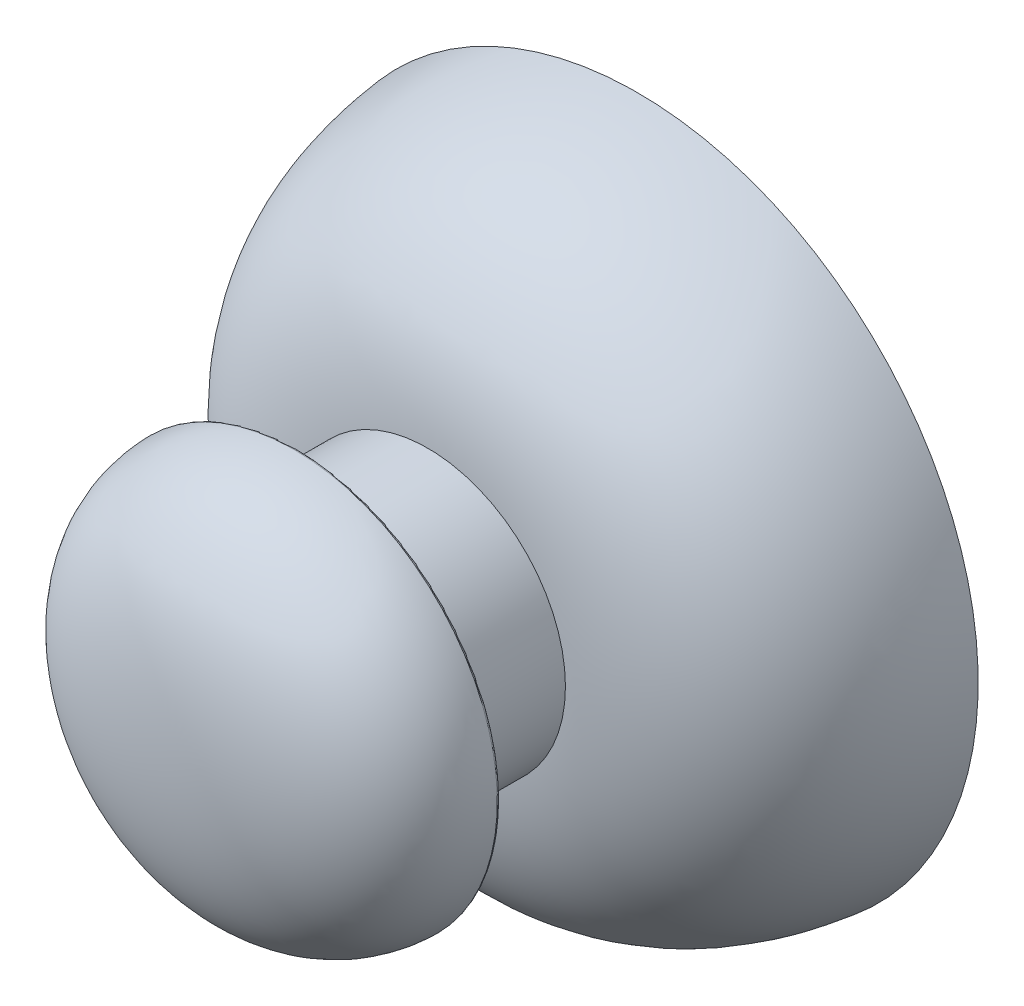
ISO-10303-21;
HEADER;
FILE_DESCRIPTION(('STEP AP214'),'2;1');
FILE_NAME('part.step','',(''),(''),'','','');
FILE_SCHEMA(('AUTOMOTIVE_DESIGN { 1 0 10303 214 1 1 1 1 }'));
ENDSEC;
DATA;
#1=APPLICATION_CONTEXT('core data for automotive mechanical design processes');
#2=APPLICATION_PROTOCOL_DEFINITION('international standard','automotive_design',2000,#1);
#3=PRODUCT_CONTEXT('',#1,'mechanical');
#4=PRODUCT('Part','Part','',(#3));
#5=PRODUCT_RELATED_PRODUCT_CATEGORY('part','',(#4));
#6=PRODUCT_DEFINITION_FORMATION('','',#4);
#7=PRODUCT_DEFINITION_CONTEXT('part definition',#1,'design');
#8=PRODUCT_DEFINITION('design','',#6,#7);
#9=PRODUCT_DEFINITION_SHAPE('','',#8);
#10=(LENGTH_UNIT() NAMED_UNIT(*) SI_UNIT(.MILLI.,.METRE.));
#11=(NAMED_UNIT(*) PLANE_ANGLE_UNIT() SI_UNIT($,.RADIAN.));
#12=(NAMED_UNIT(*) SI_UNIT($,.STERADIAN.) SOLID_ANGLE_UNIT());
#13=UNCERTAINTY_MEASURE_WITH_UNIT(LENGTH_MEASURE(1.E-05),#10,'distance_accuracy_value','');
#14=(GEOMETRIC_REPRESENTATION_CONTEXT(3) GLOBAL_UNCERTAINTY_ASSIGNED_CONTEXT((#13)) GLOBAL_UNIT_ASSIGNED_CONTEXT((#10,
#11,#12)) REPRESENTATION_CONTEXT('',''));
#15=CARTESIAN_POINT('',(0.,0.,0.));
#16=DIRECTION('',(0.,0.,1.));
#17=DIRECTION('',(1.,0.,0.));
#18=AXIS2_PLACEMENT_3D('',#15,#16,#17);
#19=CARTESIAN_POINT('',(0.,0.,0.));
#20=DIRECTION('',(0.,0.,1.));
#21=DIRECTION('',(1.,0.,0.));
#22=AXIS2_PLACEMENT_3D('',#19,#20,#21);
#23=PLANE('',#22);
#24=CARTESIAN_POINT('',(0.,0.,0.));
#25=DIRECTION('',(0.,0.,-1.));
#26=DIRECTION('',(-1.,0.,0.));
#27=AXIS2_PLACEMENT_3D('',#24,#25,#26);
#28=CIRCLE('',#27,13.);
#29=CARTESIAN_POINT('',(-13.,0.,0.));
#30=VERTEX_POINT('',#29);
#31=EDGE_CURVE('E82',#30,#30,#28,.T.);
#32=ORIENTED_EDGE('',*,*,#31,.T.);
#33=EDGE_LOOP('',(#32));
#34=FACE_BOUND('',#33,.T.);
#35=ADVANCED_FACE('F38',(#34),#23,.F.);
#36=CARTESIAN_POINT('',(0.,-5.24999999999999,8.));
#37=CARTESIAN_POINT('',(0.,-9.67903261933591,7.74672348654233));
#38=CARTESIAN_POINT('',(0.,-12.4568639272417,5.06893435293801));
#39=CARTESIAN_POINT('',(0.,-13.,0.));
#40=B_SPLINE_CURVE_WITH_KNOTS('',3,(#36,#37,#38,#39),.UNSPECIFIED.,.F.,.F.,(4,4),(0.,1.),.UNSPECIFIED.);
#41=CARTESIAN_POINT('',(0.,0.,0.));
#42=DIRECTION('',(0.,0.,-1.));
#43=AXIS1_PLACEMENT('',#41,#42);
#44=SURFACE_OF_REVOLUTION('',#40,#43);
#45=ORIENTED_EDGE('',*,*,#31,.F.);
#46=EDGE_LOOP('',(#45));
#47=FACE_BOUND('',#46,.T.);
#48=CARTESIAN_POINT('',(0.,0.,8.));
#49=DIRECTION('',(0.,0.,1.));
#50=DIRECTION('',(1.,0.,0.));
#51=AXIS2_PLACEMENT_3D('',#48,#49,#50);
#52=CIRCLE('',#51,5.25);
#53=CARTESIAN_POINT('',(5.25,0.,8.));
#54=VERTEX_POINT('',#53);
#55=EDGE_CURVE('E81',#54,#54,#52,.T.);
#56=ORIENTED_EDGE('',*,*,#55,.F.);
#57=EDGE_LOOP('',(#56));
#58=FACE_BOUND('',#57,.T.);
#59=ADVANCED_FACE('F65',(#47,#58),#44,.T.);
#60=CARTESIAN_POINT('',(0.,0.,13.));
#61=DIRECTION('',(0.,0.,-1.));
#62=DIRECTION('',(-1.,0.,0.));
#63=AXIS2_PLACEMENT_3D('',#60,#61,#62);
#64=CYLINDRICAL_SURFACE('',#63,5.25);
#65=CARTESIAN_POINT('',(0.,0.,12.9));
#66=DIRECTION('',(0.,0.,-1.));
#67=DIRECTION('',(-1.,0.,0.));
#68=AXIS2_PLACEMENT_3D('',#65,#66,#67);
#69=CIRCLE('',#68,5.25);
#70=CARTESIAN_POINT('',(-5.25,0.,12.9));
#71=VERTEX_POINT('',#70);
#72=EDGE_CURVE('E11',#71,#71,#69,.T.);
#73=ORIENTED_EDGE('',*,*,#72,.T.);
#74=EDGE_LOOP('',(#73));
#75=FACE_BOUND('',#74,.T.);
#76=ORIENTED_EDGE('',*,*,#55,.T.);
#77=EDGE_LOOP('',(#76));
#78=FACE_BOUND('',#77,.T.);
#79=ADVANCED_FACE('F59',(#75,#78),#64,.T.);
#80=CARTESIAN_POINT('',(0.,7.75465321046683,13.));
#81=DIRECTION('',(0.,0.,-1.));
#82=DIRECTION('',(-1.,0.,0.));
#83=AXIS2_PLACEMENT_3D('',#80,#81,#82);
#84=PLANE('',#83);
#85=CARTESIAN_POINT('',(0.,0.,13.));
#86=DIRECTION('',(0.,0.,-1.));
#87=DIRECTION('',(-1.,0.,0.));
#88=AXIS2_PLACEMENT_3D('',#85,#86,#87);
#89=CIRCLE('',#88,7.65380865377125);
#90=CARTESIAN_POINT('',(-7.65380865377125,0.,13.));
#91=VERTEX_POINT('',#90);
#92=EDGE_CURVE('E90',#91,#91,#89,.T.);
#93=ORIENTED_EDGE('',*,*,#92,.T.);
#94=EDGE_LOOP('',(#93));
#95=FACE_BOUND('',#94,.T.);
#96=CARTESIAN_POINT('',(0.,0.,13.));
#97=DIRECTION('',(0.,0.,-1.));
#98=DIRECTION('',(-1.,0.,0.));
#99=AXIS2_PLACEMENT_3D('',#96,#97,#98);
#100=CIRCLE('',#99,5.35);
#101=CARTESIAN_POINT('',(-5.35,0.,13.));
#102=VERTEX_POINT('',#101);
#103=EDGE_CURVE('E87',#102,#102,#100,.F.);
#104=ORIENTED_EDGE('',*,*,#103,.T.);
#105=EDGE_LOOP('',(#104));
#106=FACE_BOUND('',#105,.T.);
#107=ADVANCED_FACE('F51',(#95,#106),#84,.T.);
#108=CARTESIAN_POINT('',(0.,7.75465321046683,13.));
#109=CARTESIAN_POINT('',(0.,7.75465321046684,13.9392610767587));
#110=CARTESIAN_POINT('',(0.,7.56404747964996,18.));
#111=CARTESIAN_POINT('',(0.,0.,18.));
#112=B_SPLINE_CURVE_WITH_KNOTS('',3,(#108,#109,#110,#111),.UNSPECIFIED.,.F.,.F.,(4,4),(0.,1.),.UNSPECIFIED.);
#113=CARTESIAN_POINT('',(0.,0.,13.));
#114=DIRECTION('',(0.,0.,-1.));
#115=AXIS1_PLACEMENT('',#113,#114);
#116=SURFACE_OF_REVOLUTION('',#112,#115);
#117=CARTESIAN_POINT('',(0.,0.,13.1017710128545));
#118=DIRECTION('',(0.,0.,-1.));
#119=DIRECTION('',(-1.,0.,0.));
#120=AXIS2_PLACEMENT_3D('',#117,#118,#119);
#121=CIRCLE('',#120,7.75379297010871);
#122=CARTESIAN_POINT('',(-7.75379297010871,0.,13.1017710128545));
#123=VERTEX_POINT('',#122);
#124=EDGE_CURVE('E45',#123,#123,#121,.F.);
#125=ORIENTED_EDGE('',*,*,#124,.T.);
#126=EDGE_LOOP('',(#125));
#127=FACE_BOUND('',#126,.T.);
#128=CARTESIAN_POINT('',(0.,0.,18.));
#129=VERTEX_POINT('',#128);
#130=VERTEX_LOOP('',#129);
#131=FACE_BOUND('',#130,.T.);
#132=ADVANCED_FACE('F48',(#127,#131),#116,.F.);
#133=CARTESIAN_POINT('',(0.,0.,13.1));
#134=DIRECTION('',(0.,0.,-1.));
#135=DIRECTION('',(-1.,0.,0.));
#136=AXIS2_PLACEMENT_3D('',#133,#134,#135);
#137=TOROIDAL_SURFACE('',#136,7.65380865377125,0.1);
#138=ORIENTED_EDGE('',*,*,#124,.F.);
#139=EDGE_LOOP('',(#138));
#140=FACE_BOUND('',#139,.T.);
#141=ORIENTED_EDGE('',*,*,#92,.F.);
#142=EDGE_LOOP('',(#141));
#143=FACE_BOUND('',#142,.T.);
#144=ADVANCED_FACE('F50',(#140,#143),#137,.T.);
#145=CARTESIAN_POINT('',(0.,0.,12.9));
#146=DIRECTION('',(0.,0.,-1.));
#147=DIRECTION('',(-1.,0.,0.));
#148=AXIS2_PLACEMENT_3D('',#145,#146,#147);
#149=TOROIDAL_SURFACE('',#148,5.35,0.1);
#150=ORIENTED_EDGE('',*,*,#72,.F.);
#151=EDGE_LOOP('',(#150));
#152=FACE_BOUND('',#151,.T.);
#153=ORIENTED_EDGE('',*,*,#103,.F.);
#154=EDGE_LOOP('',(#153));
#155=FACE_BOUND('',#154,.T.);
#156=ADVANCED_FACE('F40',(#152,#155),#149,.F.);
#157=CLOSED_SHELL('',(#35,#59,#79,#107,#132,#144,#156));
#158=MANIFOLD_SOLID_BREP('B2',#157);
#159=ADVANCED_BREP_SHAPE_REPRESENTATION('',(#18,#158),#14);
#160=SHAPE_DEFINITION_REPRESENTATION(#9,#159);
ENDSEC;
END-ISO-10303-21;
